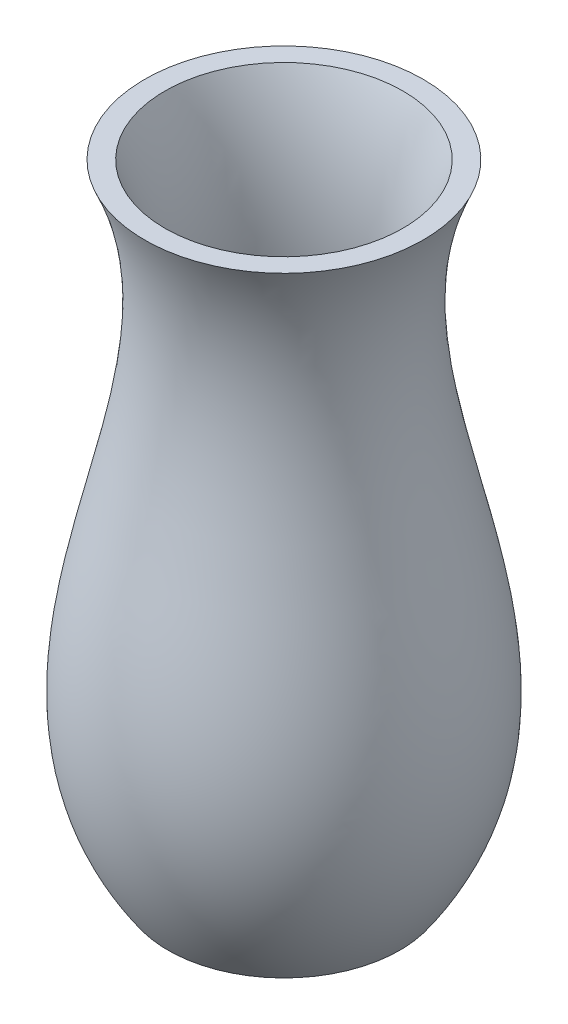
ISO-10303-21;
HEADER;
FILE_DESCRIPTION(('STEP AP214'),'2;1');
FILE_NAME('part.step','',(''),(''),'','','');
FILE_SCHEMA(('AUTOMOTIVE_DESIGN { 1 0 10303 214 1 1 1 1 }'));
ENDSEC;
DATA;
#1=APPLICATION_CONTEXT('core data for automotive mechanical design processes');
#2=APPLICATION_PROTOCOL_DEFINITION('international standard','automotive_design',2000,#1);
#3=PRODUCT_CONTEXT('',#1,'mechanical');
#4=PRODUCT('Part','Part','',(#3));
#5=PRODUCT_RELATED_PRODUCT_CATEGORY('part','',(#4));
#6=PRODUCT_DEFINITION_FORMATION('','',#4);
#7=PRODUCT_DEFINITION_CONTEXT('part definition',#1,'design');
#8=PRODUCT_DEFINITION('design','',#6,#7);
#9=PRODUCT_DEFINITION_SHAPE('','',#8);
#10=(LENGTH_UNIT() NAMED_UNIT(*) SI_UNIT(.MILLI.,.METRE.));
#11=(NAMED_UNIT(*) PLANE_ANGLE_UNIT() SI_UNIT($,.RADIAN.));
#12=(NAMED_UNIT(*) SI_UNIT($,.STERADIAN.) SOLID_ANGLE_UNIT());
#13=UNCERTAINTY_MEASURE_WITH_UNIT(LENGTH_MEASURE(1.E-05),#10,'distance_accuracy_value','');
#14=(GEOMETRIC_REPRESENTATION_CONTEXT(3) GLOBAL_UNCERTAINTY_ASSIGNED_CONTEXT((#13)) GLOBAL_UNIT_ASSIGNED_CONTEXT((#10,
#11,#12)) REPRESENTATION_CONTEXT('',''));
#15=CARTESIAN_POINT('',(0.,0.,0.));
#16=DIRECTION('',(0.,0.,1.));
#17=DIRECTION('',(1.,0.,0.));
#18=AXIS2_PLACEMENT_3D('',#15,#16,#17);
#19=CARTESIAN_POINT('',(21.7177446644965,2.28621956788026,0.));
#20=DIRECTION('',(0.,1.,0.));
#21=DIRECTION('',(0.,0.,1.));
#22=AXIS2_PLACEMENT_3D('',#19,#20,#21);
#23=PLANE('',#22);
#24=CARTESIAN_POINT('',(0.,2.28621956788026,0.));
#25=DIRECTION('',(0.,-1.,0.));
#26=DIRECTION('',(0.,0.,-1.));
#27=AXIS2_PLACEMENT_3D('',#24,#25,#26);
#28=CIRCLE('',#27,21.7177446644964);
#29=CARTESIAN_POINT('',(0.,2.28621956788026,-21.7177446644964));
#30=VERTEX_POINT('',#29);
#31=EDGE_CURVE('E10',#30,#30,#28,.T.);
#32=ORIENTED_EDGE('',*,*,#31,.F.);
#33=EDGE_LOOP('',(#32));
#34=FACE_BOUND('',#33,.T.);
#35=ADVANCED_FACE('F37',(#34),#23,.T.);
#36=CARTESIAN_POINT('',(26.3573863194946,136.652816958354,0.));
#37=CARTESIAN_POINT('',(26.0158658813683,135.900146044228,0.));
#38=CARTESIAN_POINT('',(25.3578279582978,134.372877230674,0.));
#39=CARTESIAN_POINT('',(24.1873288027534,131.340893937377,0.));
#40=CARTESIAN_POINT('',(22.9667169397455,127.545082818989,0.));
#41=CARTESIAN_POINT('',(21.8711919074732,123.003753473645,0.));
#42=CARTESIAN_POINT('',(20.8629982637025,116.970203571403,0.));
#43=CARTESIAN_POINT('',(20.3792006849652,109.486447305759,0.));
#44=CARTESIAN_POINT('',(20.7952643402315,100.626459463256,0.));
#45=CARTESIAN_POINT('',(21.9622404359108,91.8923556550851,0.));
#46=CARTESIAN_POINT('',(24.2039829844561,80.4063275875687,0.));
#47=CARTESIAN_POINT('',(27.720118631649,66.3218011858961,0.));
#48=CARTESIAN_POINT('',(30.7376292436333,52.5701225330011,0.));
#49=CARTESIAN_POINT('',(32.0400967332872,41.7820478096476,0.));
#50=CARTESIAN_POINT('',(32.2733734494395,33.7978938288802,0.));
#51=CARTESIAN_POINT('',(31.5813912629121,25.9063846519362,0.));
#52=CARTESIAN_POINT('',(30.0820120081145,19.3751868944194,0.));
#53=CARTESIAN_POINT('',(28.2267094786449,14.1458076550663,0.));
#54=CARTESIAN_POINT('',(26.4796985446661,10.2147673496848,0.));
#55=CARTESIAN_POINT('',(24.6989278829939,6.92002502835363,0.));
#56=CARTESIAN_POINT('',(23.071780443942,4.28172570023635,0.));
#57=CARTESIAN_POINT('',(22.1741092074667,2.94140868073167,0.));
#58=CARTESIAN_POINT('',(21.7177446644964,2.28621956788026,0.));
#59=B_SPLINE_CURVE_WITH_KNOTS('',3,(#36,#37,#38,#39,#40,#41,#42,#43,#44,#45,#46,#47,#48,#49,#50,
#51,#52,#53,#54,#55,#56,#57,#58),.UNSPECIFIED.,.F.,.F.,(4,1,1,1,1,1,1,1,1,1,1,1,1,1,1,1,1,1,1,1,
4),(0.,0.015625,0.03125,0.0625,0.09375,0.125,0.1875,0.25,0.3125,0.375,0.5,0.625,0.6875,0.75,
0.8125,0.875,0.90625,0.9375,0.96875,0.984375,1.),.UNSPECIFIED.);
#60=CARTESIAN_POINT('',(0.,0.,0.));
#61=DIRECTION('',(0.,-1.,0.));
#62=AXIS1_PLACEMENT('',#60,#61);
#63=SURFACE_OF_REVOLUTION('',#59,#62);
#64=ORIENTED_EDGE('',*,*,#31,.T.);
#65=EDGE_LOOP('',(#64));
#66=FACE_BOUND('',#65,.T.);
#67=CARTESIAN_POINT('',(0.,135.,0.));
#68=DIRECTION('',(0.,-1.,0.));
#69=DIRECTION('',(0.,0.,-1.));
#70=AXIS2_PLACEMENT_3D('',#67,#68,#69);
#71=CIRCLE('',#70,25.6348968617745);
#72=CARTESIAN_POINT('',(0.,135.,-25.6348968617745));
#73=VERTEX_POINT('',#72);
#74=EDGE_CURVE('E44',#73,#73,#71,.T.);
#75=ORIENTED_EDGE('',*,*,#74,.F.);
#76=EDGE_LOOP('',(#75));
#77=FACE_BOUND('',#76,.T.);
#78=ADVANCED_FACE('F70',(#66,#77),#63,.F.);
#79=CARTESIAN_POINT('',(30.,135.,0.));
#80=DIRECTION('',(0.,1.,0.));
#81=DIRECTION('',(0.,0.,1.));
#82=AXIS2_PLACEMENT_3D('',#79,#80,#81);
#83=PLANE('',#82);
#84=ORIENTED_EDGE('',*,*,#74,.T.);
#85=EDGE_LOOP('',(#84));
#86=FACE_BOUND('',#85,.T.);
#87=CARTESIAN_POINT('',(0.,135.,0.));
#88=DIRECTION('',(0.,-1.,0.));
#89=DIRECTION('',(0.,0.,-1.));
#90=AXIS2_PLACEMENT_3D('',#87,#88,#89);
#91=CIRCLE('',#90,30.);
#92=CARTESIAN_POINT('',(0.,135.,-30.));
#93=VERTEX_POINT('',#92);
#94=EDGE_CURVE('E49',#93,#93,#91,.T.);
#95=ORIENTED_EDGE('',*,*,#94,.F.);
#96=EDGE_LOOP('',(#95));
#97=FACE_BOUND('',#96,.T.);
#98=ADVANCED_FACE('F73',(#86,#97),#83,.T.);
#99=CARTESIAN_POINT('',(25.,0.,0.));
#100=CARTESIAN_POINT('',(56.3983585513055,45.077660662588,0.));
#101=CARTESIAN_POINT('',(9.30717601840684,89.3954936068366,0.));
#102=CARTESIAN_POINT('',(30.,135.,0.));
#103=B_SPLINE_CURVE_WITH_KNOTS('',3,(#99,#100,#101,#102),.UNSPECIFIED.,.F.,.F.,(4,4),(0.,1.),.UNSPECIFIED.);
#104=CARTESIAN_POINT('',(0.,0.,0.));
#105=DIRECTION('',(0.,-1.,0.));
#106=AXIS1_PLACEMENT('',#104,#105);
#107=SURFACE_OF_REVOLUTION('',#103,#106);
#108=ORIENTED_EDGE('',*,*,#94,.T.);
#109=EDGE_LOOP('',(#108));
#110=FACE_BOUND('',#109,.T.);
#111=CARTESIAN_POINT('',(0.,0.,0.));
#112=DIRECTION('',(0.,-1.,0.));
#113=DIRECTION('',(0.,0.,-1.));
#114=AXIS2_PLACEMENT_3D('',#111,#112,#113);
#115=CIRCLE('',#114,25.);
#116=CARTESIAN_POINT('',(0.,0.,-25.));
#117=VERTEX_POINT('',#116);
#118=EDGE_CURVE('E54',#117,#117,#115,.T.);
#119=ORIENTED_EDGE('',*,*,#118,.F.);
#120=EDGE_LOOP('',(#119));
#121=FACE_BOUND('',#120,.T.);
#122=ADVANCED_FACE('F76',(#110,#121),#107,.F.);
#123=CARTESIAN_POINT('',(0.,0.,0.));
#124=DIRECTION('',(0.,-1.,0.));
#125=DIRECTION('',(0.,0.,-1.));
#126=AXIS2_PLACEMENT_3D('',#123,#124,#125);
#127=PLANE('',#126);
#128=ORIENTED_EDGE('',*,*,#118,.T.);
#129=EDGE_LOOP('',(#128));
#130=FACE_BOUND('',#129,.T.);
#131=ADVANCED_FACE('F79',(#130),#127,.T.);
#132=CLOSED_SHELL('',(#35,#78,#98,#122,#131));
#133=MANIFOLD_SOLID_BREP('B2',#132);
#134=ADVANCED_BREP_SHAPE_REPRESENTATION('',(#18,#133),#14);
#135=SHAPE_DEFINITION_REPRESENTATION(#9,#134);
ENDSEC;
END-ISO-10303-21;
